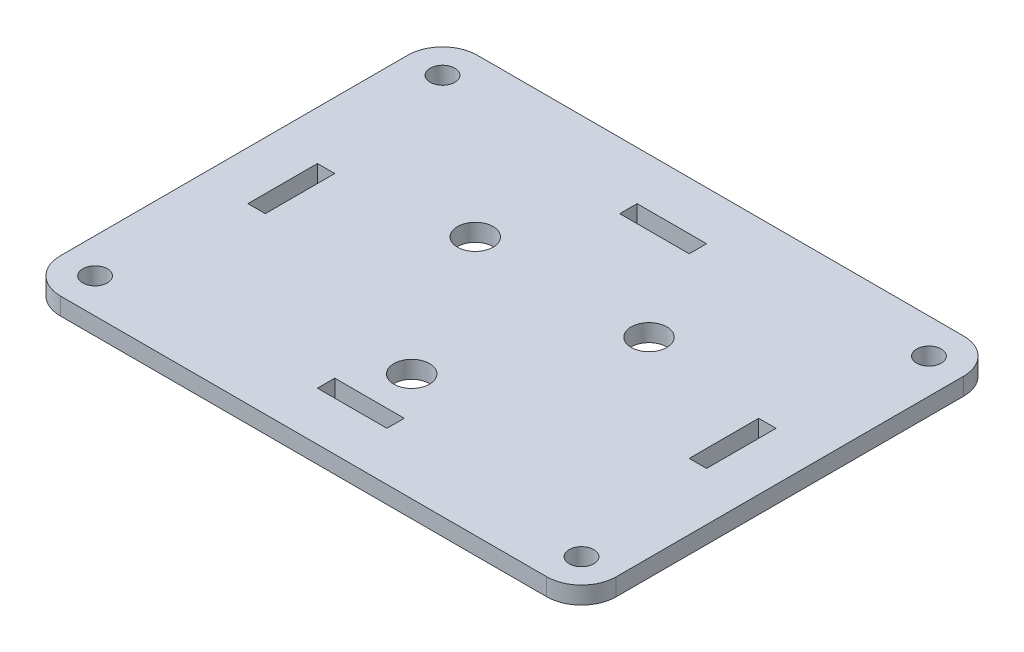
ISO-10303-21;
HEADER;
FILE_DESCRIPTION(('STEP AP214'),'2;1');
FILE_NAME('part.step','',(''),(''),'','','');
FILE_SCHEMA(('AUTOMOTIVE_DESIGN { 1 0 10303 214 1 1 1 1 }'));
ENDSEC;
DATA;
#1=APPLICATION_CONTEXT('core data for automotive mechanical design processes');
#2=APPLICATION_PROTOCOL_DEFINITION('international standard','automotive_design',2000,#1);
#3=PRODUCT_CONTEXT('',#1,'mechanical');
#4=PRODUCT('Part','Part','',(#3));
#5=PRODUCT_RELATED_PRODUCT_CATEGORY('part','',(#4));
#6=PRODUCT_DEFINITION_FORMATION('','',#4);
#7=PRODUCT_DEFINITION_CONTEXT('part definition',#1,'design');
#8=PRODUCT_DEFINITION('design','',#6,#7);
#9=PRODUCT_DEFINITION_SHAPE('','',#8);
#10=(LENGTH_UNIT() NAMED_UNIT(*) SI_UNIT(.MILLI.,.METRE.));
#11=(NAMED_UNIT(*) PLANE_ANGLE_UNIT() SI_UNIT($,.RADIAN.));
#12=(NAMED_UNIT(*) SI_UNIT($,.STERADIAN.) SOLID_ANGLE_UNIT());
#13=UNCERTAINTY_MEASURE_WITH_UNIT(LENGTH_MEASURE(1.E-05),#10,'distance_accuracy_value','');
#14=(GEOMETRIC_REPRESENTATION_CONTEXT(3) GLOBAL_UNCERTAINTY_ASSIGNED_CONTEXT((#13)) GLOBAL_UNIT_ASSIGNED_CONTEXT((#10,
#11,#12)) REPRESENTATION_CONTEXT('',''));
#15=CARTESIAN_POINT('',(0.,0.,0.));
#16=DIRECTION('',(0.,0.,1.));
#17=DIRECTION('',(1.,0.,0.));
#18=AXIS2_PLACEMENT_3D('',#15,#16,#17);
#19=CARTESIAN_POINT('',(50.8,3.175,38.1));
#20=DIRECTION('',(-1.,0.,0.));
#21=DIRECTION('',(0.,0.,1.));
#22=AXIS2_PLACEMENT_3D('',#19,#20,#21);
#23=PLANE('',#22);
#24=DIRECTION('',(0.,0.,-1.));
#25=VECTOR('',#24,1.);
#26=CARTESIAN_POINT('',(50.8,3.175,38.1));
#27=LINE('',#26,#25);
#28=CARTESIAN_POINT('',(50.8,3.175,31.75));
#29=VERTEX_POINT('',#28);
#30=CARTESIAN_POINT('',(50.8,3.175,-31.75));
#31=VERTEX_POINT('',#30);
#32=EDGE_CURVE('E395',#29,#31,#27,.T.);
#33=ORIENTED_EDGE('',*,*,#32,.F.);
#34=DIRECTION('',(0.,-1.,0.));
#35=VECTOR('',#34,1.);
#36=CARTESIAN_POINT('',(50.8,3.175,31.75));
#37=LINE('',#36,#35);
#38=CARTESIAN_POINT('',(50.8,0.,31.75));
#39=VERTEX_POINT('',#38);
#40=EDGE_CURVE('E429',#29,#39,#37,.T.);
#41=ORIENTED_EDGE('',*,*,#40,.T.);
#42=DIRECTION('',(0.,0.,-1.));
#43=VECTOR('',#42,1.);
#44=CARTESIAN_POINT('',(50.8,0.,38.1));
#45=LINE('',#44,#43);
#46=CARTESIAN_POINT('',(50.8,0.,-31.75));
#47=VERTEX_POINT('',#46);
#48=EDGE_CURVE('E386',#39,#47,#45,.T.);
#49=ORIENTED_EDGE('',*,*,#48,.T.);
#50=DIRECTION('',(0.,-1.,0.));
#51=VECTOR('',#50,1.);
#52=CARTESIAN_POINT('',(50.8,3.175,-31.75));
#53=LINE('',#52,#51);
#54=EDGE_CURVE('E412',#47,#31,#53,.F.);
#55=ORIENTED_EDGE('',*,*,#54,.T.);
#56=EDGE_LOOP('',(#33,#41,#49,#55));
#57=FACE_BOUND('',#56,.T.);
#58=ADVANCED_FACE('F39',(#57),#23,.F.);
#59=CARTESIAN_POINT('',(-50.8,3.175,-38.1));
#60=DIRECTION('',(0.,0.,1.));
#61=DIRECTION('',(1.,0.,0.));
#62=AXIS2_PLACEMENT_3D('',#59,#60,#61);
#63=PLANE('',#62);
#64=DIRECTION('',(-1.,0.,0.));
#65=VECTOR('',#64,1.);
#66=CARTESIAN_POINT('',(-50.8,3.175,-38.1));
#67=LINE('',#66,#65);
#68=CARTESIAN_POINT('',(44.45,3.175,-38.1));
#69=VERTEX_POINT('',#68);
#70=CARTESIAN_POINT('',(-44.45,3.175,-38.1));
#71=VERTEX_POINT('',#70);
#72=EDGE_CURVE('E399',#69,#71,#67,.T.);
#73=ORIENTED_EDGE('',*,*,#72,.F.);
#74=DIRECTION('',(0.,-1.,0.));
#75=VECTOR('',#74,1.);
#76=CARTESIAN_POINT('',(44.45,3.175,-38.1));
#77=LINE('',#76,#75);
#78=CARTESIAN_POINT('',(44.45,0.,-38.1));
#79=VERTEX_POINT('',#78);
#80=EDGE_CURVE('E467',#69,#79,#77,.T.);
#81=ORIENTED_EDGE('',*,*,#80,.T.);
#82=DIRECTION('',(-1.,0.,0.));
#83=VECTOR('',#82,1.);
#84=CARTESIAN_POINT('',(-50.8,0.,-38.1));
#85=LINE('',#84,#83);
#86=CARTESIAN_POINT('',(-44.45,0.,-38.1));
#87=VERTEX_POINT('',#86);
#88=EDGE_CURVE('E416',#79,#87,#85,.T.);
#89=ORIENTED_EDGE('',*,*,#88,.T.);
#90=DIRECTION('',(0.,-1.,0.));
#91=VECTOR('',#90,1.);
#92=CARTESIAN_POINT('',(-44.45,3.175,-38.1));
#93=LINE('',#92,#91);
#94=EDGE_CURVE('E464',#87,#71,#93,.F.);
#95=ORIENTED_EDGE('',*,*,#94,.T.);
#96=EDGE_LOOP('',(#73,#81,#89,#95));
#97=FACE_BOUND('',#96,.T.);
#98=ADVANCED_FACE('F504',(#97),#63,.F.);
#99=CARTESIAN_POINT('',(-50.8,3.175,38.1));
#100=DIRECTION('',(1.,0.,0.));
#101=DIRECTION('',(0.,0.,-1.));
#102=AXIS2_PLACEMENT_3D('',#99,#100,#101);
#103=PLANE('',#102);
#104=DIRECTION('',(0.,0.,1.));
#105=VECTOR('',#104,1.);
#106=CARTESIAN_POINT('',(-50.8,3.175,38.1));
#107=LINE('',#106,#105);
#108=CARTESIAN_POINT('',(-50.8,3.175,-31.75));
#109=VERTEX_POINT('',#108);
#110=CARTESIAN_POINT('',(-50.8,3.175,31.75));
#111=VERTEX_POINT('',#110);
#112=EDGE_CURVE('E404',#109,#111,#107,.T.);
#113=ORIENTED_EDGE('',*,*,#112,.F.);
#114=DIRECTION('',(0.,-1.,0.));
#115=VECTOR('',#114,1.);
#116=CARTESIAN_POINT('',(-50.8,3.175,-31.75));
#117=LINE('',#116,#115);
#118=CARTESIAN_POINT('',(-50.8,0.,-31.75));
#119=VERTEX_POINT('',#118);
#120=EDGE_CURVE('E11',#109,#119,#117,.T.);
#121=ORIENTED_EDGE('',*,*,#120,.T.);
#122=DIRECTION('',(0.,0.,1.));
#123=VECTOR('',#122,1.);
#124=CARTESIAN_POINT('',(-50.8,0.,38.1));
#125=LINE('',#124,#123);
#126=CARTESIAN_POINT('',(-50.8,0.,31.75));
#127=VERTEX_POINT('',#126);
#128=EDGE_CURVE('E420',#119,#127,#125,.T.);
#129=ORIENTED_EDGE('',*,*,#128,.T.);
#130=DIRECTION('',(0.,-1.,0.));
#131=VECTOR('',#130,1.);
#132=CARTESIAN_POINT('',(-50.8,3.175,31.75));
#133=LINE('',#132,#131);
#134=EDGE_CURVE('E48',#127,#111,#133,.F.);
#135=ORIENTED_EDGE('',*,*,#134,.T.);
#136=EDGE_LOOP('',(#113,#121,#129,#135));
#137=FACE_BOUND('',#136,.T.);
#138=ADVANCED_FACE('F474',(#137),#103,.F.);
#139=CARTESIAN_POINT('',(-50.8,3.175,38.1));
#140=DIRECTION('',(0.,0.,-1.));
#141=DIRECTION('',(-1.,0.,0.));
#142=AXIS2_PLACEMENT_3D('',#139,#140,#141);
#143=PLANE('',#142);
#144=DIRECTION('',(1.,0.,0.));
#145=VECTOR('',#144,1.);
#146=CARTESIAN_POINT('',(-50.8,0.,38.1));
#147=LINE('',#146,#145);
#148=CARTESIAN_POINT('',(-44.45,0.,38.1));
#149=VERTEX_POINT('',#148);
#150=CARTESIAN_POINT('',(44.45,0.,38.1));
#151=VERTEX_POINT('',#150);
#152=EDGE_CURVE('E400',#149,#151,#147,.T.);
#153=ORIENTED_EDGE('',*,*,#152,.T.);
#154=DIRECTION('',(0.,-1.,0.));
#155=VECTOR('',#154,1.);
#156=CARTESIAN_POINT('',(44.45,3.175,38.1));
#157=LINE('',#156,#155);
#158=CARTESIAN_POINT('',(44.45,3.175,38.1));
#159=VERTEX_POINT('',#158);
#160=EDGE_CURVE('E449',#151,#159,#157,.F.);
#161=ORIENTED_EDGE('',*,*,#160,.T.);
#162=DIRECTION('',(1.,0.,0.));
#163=VECTOR('',#162,1.);
#164=CARTESIAN_POINT('',(-50.8,3.175,38.1));
#165=LINE('',#164,#163);
#166=CARTESIAN_POINT('',(-44.45,3.175,38.1));
#167=VERTEX_POINT('',#166);
#168=EDGE_CURVE('E408',#167,#159,#165,.T.);
#169=ORIENTED_EDGE('',*,*,#168,.F.);
#170=DIRECTION('',(0.,-1.,0.));
#171=VECTOR('',#170,1.);
#172=CARTESIAN_POINT('',(-44.45,3.175,38.1));
#173=LINE('',#172,#171);
#174=EDGE_CURVE('E445',#167,#149,#173,.T.);
#175=ORIENTED_EDGE('',*,*,#174,.T.);
#176=EDGE_LOOP('',(#153,#161,#169,#175));
#177=FACE_BOUND('',#176,.T.);
#178=ADVANCED_FACE('F486',(#177),#143,.F.);
#179=CARTESIAN_POINT('',(0.,3.175,0.));
#180=DIRECTION('',(0.,-1.,0.));
#181=DIRECTION('',(0.,0.,-1.));
#182=AXIS2_PLACEMENT_3D('',#179,#180,#181);
#183=PLANE('',#182);
#184=CARTESIAN_POINT('',(-15.875,3.175,-9.16543552338531));
#185=DIRECTION('',(0.,1.,0.));
#186=DIRECTION('',(0.,0.,1.));
#187=AXIS2_PLACEMENT_3D('',#184,#185,#186);
#188=CIRCLE('',#187,3.2639);
#189=CARTESIAN_POINT('',(-15.875,3.175,-5.9015355233853));
#190=VERTEX_POINT('',#189);
#191=EDGE_CURVE('E882',#190,#190,#188,.T.);
#192=ORIENTED_EDGE('',*,*,#191,.F.);
#193=EDGE_LOOP('',(#192));
#194=FACE_BOUND('',#193,.T.);
#195=CARTESIAN_POINT('',(15.875,3.175,-9.16543552338531));
#196=DIRECTION('',(0.,1.,0.));
#197=DIRECTION('',(0.,0.,1.));
#198=AXIS2_PLACEMENT_3D('',#195,#196,#197);
#199=CIRCLE('',#198,3.2639);
#200=CARTESIAN_POINT('',(15.875,3.175,-5.9015355233853));
#201=VERTEX_POINT('',#200);
#202=EDGE_CURVE('E874',#201,#201,#199,.T.);
#203=ORIENTED_EDGE('',*,*,#202,.F.);
#204=EDGE_LOOP('',(#203));
#205=FACE_BOUND('',#204,.T.);
#206=CARTESIAN_POINT('',(0.,3.175,18.3308710467706));
#207=DIRECTION('',(0.,1.,0.));
#208=DIRECTION('',(0.,0.,1.));
#209=AXIS2_PLACEMENT_3D('',#206,#207,#208);
#210=CIRCLE('',#209,3.2639);
#211=CARTESIAN_POINT('',(0.,3.175,21.5947710467706));
#212=VERTEX_POINT('',#211);
#213=EDGE_CURVE('E866',#212,#212,#210,.T.);
#214=ORIENTED_EDGE('',*,*,#213,.F.);
#215=EDGE_LOOP('',(#214));
#216=FACE_BOUND('',#215,.T.);
#217=CARTESIAN_POINT('',(-44.45,3.175,-31.75));
#218=DIRECTION('',(0.,1.,0.));
#219=DIRECTION('',(0.,0.,1.));
#220=AXIS2_PLACEMENT_3D('',#217,#218,#219);
#221=CIRCLE('',#220,2.2479);
#222=CARTESIAN_POINT('',(-44.45,3.175,-29.5021));
#223=VERTEX_POINT('',#222);
#224=EDGE_CURVE('E260',#223,#223,#221,.T.);
#225=ORIENTED_EDGE('',*,*,#224,.F.);
#226=EDGE_LOOP('',(#225));
#227=FACE_BOUND('',#226,.T.);
#228=DIRECTION('',(1.,0.,0.));
#229=VECTOR('',#228,1.);
#230=CARTESIAN_POINT('',(0.,3.175,29.21));
#231=LINE('',#230,#229);
#232=CARTESIAN_POINT('',(-6.35,3.175,29.21));
#233=VERTEX_POINT('',#232);
#234=CARTESIAN_POINT('',(6.35,3.175,29.21));
#235=VERTEX_POINT('',#234);
#236=EDGE_CURVE('E237',#233,#235,#231,.T.);
#237=ORIENTED_EDGE('',*,*,#236,.F.);
#238=DIRECTION('',(0.,0.,1.));
#239=VECTOR('',#238,1.);
#240=CARTESIAN_POINT('',(-6.35,3.175,26.035));
#241=LINE('',#240,#239);
#242=CARTESIAN_POINT('',(-6.35,3.175,26.035));
#243=VERTEX_POINT('',#242);
#244=EDGE_CURVE('E55',#243,#233,#241,.T.);
#245=ORIENTED_EDGE('',*,*,#244,.F.);
#246=DIRECTION('',(-1.,0.,0.));
#247=VECTOR('',#246,1.);
#248=CARTESIAN_POINT('',(6.35,3.175,26.035));
#249=LINE('',#248,#247);
#250=CARTESIAN_POINT('',(6.35,3.175,26.035));
#251=VERTEX_POINT('',#250);
#252=EDGE_CURVE('E244',#251,#243,#249,.T.);
#253=ORIENTED_EDGE('',*,*,#252,.F.);
#254=DIRECTION('',(0.,0.,-1.));
#255=VECTOR('',#254,1.);
#256=CARTESIAN_POINT('',(6.35,3.175,29.21));
#257=LINE('',#256,#255);
#258=EDGE_CURVE('E207',#235,#251,#257,.T.);
#259=ORIENTED_EDGE('',*,*,#258,.F.);
#260=EDGE_LOOP('',(#237,#245,#253,#259));
#261=FACE_BOUND('',#260,.T.);
#262=DIRECTION('',(0.,0.,-1.));
#263=VECTOR('',#262,1.);
#264=CARTESIAN_POINT('',(41.91,3.175,0.));
#265=LINE('',#264,#263);
#266=CARTESIAN_POINT('',(41.91,3.175,6.35));
#267=VERTEX_POINT('',#266);
#268=CARTESIAN_POINT('',(41.91,3.175,-6.35));
#269=VERTEX_POINT('',#268);
#270=EDGE_CURVE('E252',#267,#269,#265,.T.);
#271=ORIENTED_EDGE('',*,*,#270,.F.);
#272=DIRECTION('',(1.,0.,0.));
#273=VECTOR('',#272,1.);
#274=CARTESIAN_POINT('',(38.735,3.175,6.35));
#275=LINE('',#274,#273);
#276=CARTESIAN_POINT('',(38.735,3.175,6.35));
#277=VERTEX_POINT('',#276);
#278=EDGE_CURVE('E63',#277,#267,#275,.T.);
#279=ORIENTED_EDGE('',*,*,#278,.F.);
#280=DIRECTION('',(0.,0.,1.));
#281=VECTOR('',#280,1.);
#282=CARTESIAN_POINT('',(38.735,3.175,-6.35));
#283=LINE('',#282,#281);
#284=CARTESIAN_POINT('',(38.735,3.175,-6.35));
#285=VERTEX_POINT('',#284);
#286=EDGE_CURVE('E335',#285,#277,#283,.T.);
#287=ORIENTED_EDGE('',*,*,#286,.F.);
#288=DIRECTION('',(-1.,0.,0.));
#289=VECTOR('',#288,1.);
#290=CARTESIAN_POINT('',(41.91,3.175,-6.35));
#291=LINE('',#290,#289);
#292=EDGE_CURVE('E331',#269,#285,#291,.T.);
#293=ORIENTED_EDGE('',*,*,#292,.F.);
#294=EDGE_LOOP('',(#271,#279,#287,#293));
#295=FACE_BOUND('',#294,.T.);
#296=DIRECTION('',(0.,0.,1.));
#297=VECTOR('',#296,1.);
#298=CARTESIAN_POINT('',(-6.35000000000001,3.175,-26.035));
#299=LINE('',#298,#297);
#300=CARTESIAN_POINT('',(-6.35000000000001,3.175,-29.21));
#301=VERTEX_POINT('',#300);
#302=CARTESIAN_POINT('',(-6.35000000000001,3.175,-26.035));
#303=VERTEX_POINT('',#302);
#304=EDGE_CURVE('E283',#301,#303,#299,.T.);
#305=ORIENTED_EDGE('',*,*,#304,.F.);
#306=DIRECTION('',(-1.,0.,0.));
#307=VECTOR('',#306,1.);
#308=CARTESIAN_POINT('',(0.,3.175,-29.21));
#309=LINE('',#308,#307);
#310=CARTESIAN_POINT('',(6.34999999999999,3.175,-29.21));
#311=VERTEX_POINT('',#310);
#312=EDGE_CURVE('E270',#311,#301,#309,.T.);
#313=ORIENTED_EDGE('',*,*,#312,.F.);
#314=DIRECTION('',(0.,0.,-1.));
#315=VECTOR('',#314,1.);
#316=CARTESIAN_POINT('',(6.34999999999999,3.175,-29.21));
#317=LINE('',#316,#315);
#318=CARTESIAN_POINT('',(6.34999999999999,3.175,-26.035));
#319=VERTEX_POINT('',#318);
#320=EDGE_CURVE('E292',#319,#311,#317,.T.);
#321=ORIENTED_EDGE('',*,*,#320,.F.);
#322=DIRECTION('',(1.,0.,0.));
#323=VECTOR('',#322,1.);
#324=CARTESIAN_POINT('',(6.34999999999999,3.175,-26.035));
#325=LINE('',#324,#323);
#326=EDGE_CURVE('E287',#303,#319,#325,.T.);
#327=ORIENTED_EDGE('',*,*,#326,.F.);
#328=EDGE_LOOP('',(#305,#313,#321,#327));
#329=FACE_BOUND('',#328,.T.);
#330=CARTESIAN_POINT('',(44.45,3.175,-31.75));
#331=DIRECTION('',(0.,1.,0.));
#332=DIRECTION('',(0.,0.,1.));
#333=AXIS2_PLACEMENT_3D('',#330,#331,#332);
#334=CIRCLE('',#333,2.2479);
#335=CARTESIAN_POINT('',(44.45,3.175,-29.5021));
#336=VERTEX_POINT('',#335);
#337=EDGE_CURVE('E860',#336,#336,#334,.T.);
#338=ORIENTED_EDGE('',*,*,#337,.F.);
#339=EDGE_LOOP('',(#338));
#340=FACE_BOUND('',#339,.T.);
#341=CARTESIAN_POINT('',(44.45,3.175,31.75));
#342=DIRECTION('',(0.,1.,0.));
#343=DIRECTION('',(0.,0.,1.));
#344=AXIS2_PLACEMENT_3D('',#341,#342,#343);
#345=CIRCLE('',#344,2.2479);
#346=CARTESIAN_POINT('',(44.45,3.175,33.9979));
#347=VERTEX_POINT('',#346);
#348=EDGE_CURVE('E848',#347,#347,#345,.T.);
#349=ORIENTED_EDGE('',*,*,#348,.F.);
#350=EDGE_LOOP('',(#349));
#351=FACE_BOUND('',#350,.T.);
#352=CARTESIAN_POINT('',(-44.45,3.175,31.75));
#353=DIRECTION('',(0.,1.,0.));
#354=DIRECTION('',(0.,0.,1.));
#355=AXIS2_PLACEMENT_3D('',#352,#353,#354);
#356=CIRCLE('',#355,2.2479);
#357=CARTESIAN_POINT('',(-44.45,3.175,33.9979));
#358=VERTEX_POINT('',#357);
#359=EDGE_CURVE('E849',#358,#358,#356,.T.);
#360=ORIENTED_EDGE('',*,*,#359,.F.);
#361=EDGE_LOOP('',(#360));
#362=FACE_BOUND('',#361,.T.);
#363=DIRECTION('',(1.,0.,0.));
#364=VECTOR('',#363,1.);
#365=CARTESIAN_POINT('',(-38.735,3.175,6.35000000000002));
#366=LINE('',#365,#364);
#367=CARTESIAN_POINT('',(-41.91,3.175,6.35000000000001));
#368=VERTEX_POINT('',#367);
#369=CARTESIAN_POINT('',(-38.735,3.175,6.35000000000002));
#370=VERTEX_POINT('',#369);
#371=EDGE_CURVE('E302',#368,#370,#366,.T.);
#372=ORIENTED_EDGE('',*,*,#371,.F.);
#373=DIRECTION('',(0.,0.,1.));
#374=VECTOR('',#373,1.);
#375=CARTESIAN_POINT('',(-41.91,3.175,0.));
#376=LINE('',#375,#374);
#377=CARTESIAN_POINT('',(-41.91,3.175,-6.34999999999999));
#378=VERTEX_POINT('',#377);
#379=EDGE_CURVE('E356',#378,#368,#376,.T.);
#380=ORIENTED_EDGE('',*,*,#379,.F.);
#381=DIRECTION('',(-1.,0.,0.));
#382=VECTOR('',#381,1.);
#383=CARTESIAN_POINT('',(-41.91,3.175,-6.34999999999999));
#384=LINE('',#383,#382);
#385=CARTESIAN_POINT('',(-38.735,3.175,-6.34999999999999));
#386=VERTEX_POINT('',#385);
#387=EDGE_CURVE('E376',#386,#378,#384,.T.);
#388=ORIENTED_EDGE('',*,*,#387,.F.);
#389=DIRECTION('',(0.,0.,-1.));
#390=VECTOR('',#389,1.);
#391=CARTESIAN_POINT('',(-38.735,3.175,-6.34999999999999));
#392=LINE('',#391,#390);
#393=EDGE_CURVE('E372',#370,#386,#392,.T.);
#394=ORIENTED_EDGE('',*,*,#393,.F.);
#395=EDGE_LOOP('',(#372,#380,#388,#394));
#396=FACE_BOUND('',#395,.T.);
#397=ORIENTED_EDGE('',*,*,#168,.T.);
#398=CARTESIAN_POINT('',(44.45,3.175,31.75));
#399=DIRECTION('',(0.,-1.,0.));
#400=DIRECTION('',(0.,0.,-1.));
#401=AXIS2_PLACEMENT_3D('',#398,#399,#400);
#402=CIRCLE('',#401,6.35);
#403=EDGE_CURVE('E461',#159,#29,#402,.F.);
#404=ORIENTED_EDGE('',*,*,#403,.T.);
#405=ORIENTED_EDGE('',*,*,#32,.T.);
#406=CARTESIAN_POINT('',(44.45,3.175,-31.75));
#407=DIRECTION('',(0.,-1.,0.));
#408=DIRECTION('',(0.,0.,-1.));
#409=AXIS2_PLACEMENT_3D('',#406,#407,#408);
#410=CIRCLE('',#409,6.35);
#411=EDGE_CURVE('E458',#31,#69,#410,.F.);
#412=ORIENTED_EDGE('',*,*,#411,.T.);
#413=ORIENTED_EDGE('',*,*,#72,.T.);
#414=CARTESIAN_POINT('',(-44.45,3.175,-31.75));
#415=DIRECTION('',(0.,-1.,0.));
#416=DIRECTION('',(0.,0.,-1.));
#417=AXIS2_PLACEMENT_3D('',#414,#415,#416);
#418=CIRCLE('',#417,6.35);
#419=EDGE_CURVE('E455',#71,#109,#418,.F.);
#420=ORIENTED_EDGE('',*,*,#419,.T.);
#421=ORIENTED_EDGE('',*,*,#112,.T.);
#422=CARTESIAN_POINT('',(-44.45,3.175,31.75));
#423=DIRECTION('',(0.,-1.,0.));
#424=DIRECTION('',(0.,0.,-1.));
#425=AXIS2_PLACEMENT_3D('',#422,#423,#424);
#426=CIRCLE('',#425,6.35);
#427=EDGE_CURVE('E452',#111,#167,#426,.F.);
#428=ORIENTED_EDGE('',*,*,#427,.T.);
#429=EDGE_LOOP('',(#397,#404,#405,#412,#413,#420,#421,#428));
#430=FACE_BOUND('',#429,.T.);
#431=ADVANCED_FACE('F480',(#194,#205,#216,#227,#261,#295,#329,#340,#351,#362,#396,#430),#183,.F.);
#432=CARTESIAN_POINT('',(0.,0.,0.));
#433=DIRECTION('',(0.,-1.,0.));
#434=DIRECTION('',(0.,0.,-1.));
#435=AXIS2_PLACEMENT_3D('',#432,#433,#434);
#436=PLANE('',#435);
#437=CARTESIAN_POINT('',(-15.875,0.,-9.16543552338531));
#438=DIRECTION('',(0.,1.,0.));
#439=DIRECTION('',(0.,0.,1.));
#440=AXIS2_PLACEMENT_3D('',#437,#438,#439);
#441=CIRCLE('',#440,3.2639);
#442=CARTESIAN_POINT('',(-15.875,0.,-5.9015355233853));
#443=VERTEX_POINT('',#442);
#444=EDGE_CURVE('E856',#443,#443,#441,.T.);
#445=ORIENTED_EDGE('',*,*,#444,.T.);
#446=EDGE_LOOP('',(#445));
#447=FACE_BOUND('',#446,.T.);
#448=CARTESIAN_POINT('',(15.875,0.,-9.16543552338531));
#449=DIRECTION('',(0.,1.,0.));
#450=DIRECTION('',(0.,0.,1.));
#451=AXIS2_PLACEMENT_3D('',#448,#449,#450);
#452=CIRCLE('',#451,3.2639);
#453=CARTESIAN_POINT('',(15.875,0.,-5.9015355233853));
#454=VERTEX_POINT('',#453);
#455=EDGE_CURVE('E878',#454,#454,#452,.T.);
#456=ORIENTED_EDGE('',*,*,#455,.T.);
#457=EDGE_LOOP('',(#456));
#458=FACE_BOUND('',#457,.T.);
#459=CARTESIAN_POINT('',(0.,0.,18.3308710467706));
#460=DIRECTION('',(0.,1.,0.));
#461=DIRECTION('',(0.,0.,1.));
#462=AXIS2_PLACEMENT_3D('',#459,#460,#461);
#463=CIRCLE('',#462,3.2639);
#464=CARTESIAN_POINT('',(0.,0.,21.5947710467706));
#465=VERTEX_POINT('',#464);
#466=EDGE_CURVE('E870',#465,#465,#463,.T.);
#467=ORIENTED_EDGE('',*,*,#466,.T.);
#468=EDGE_LOOP('',(#467));
#469=FACE_BOUND('',#468,.T.);
#470=CARTESIAN_POINT('',(-44.45,0.,-31.75));
#471=DIRECTION('',(0.,1.,0.));
#472=DIRECTION('',(0.,0.,1.));
#473=AXIS2_PLACEMENT_3D('',#470,#471,#472);
#474=CIRCLE('',#473,2.2479);
#475=CARTESIAN_POINT('',(-44.45,0.,-29.5021));
#476=VERTEX_POINT('',#475);
#477=EDGE_CURVE('E241',#476,#476,#474,.T.);
#478=ORIENTED_EDGE('',*,*,#477,.T.);
#479=EDGE_LOOP('',(#478));
#480=FACE_BOUND('',#479,.T.);
#481=DIRECTION('',(0.,0.,1.));
#482=VECTOR('',#481,1.);
#483=CARTESIAN_POINT('',(-6.35,0.,26.035));
#484=LINE('',#483,#482);
#485=CARTESIAN_POINT('',(-6.35,0.,26.035));
#486=VERTEX_POINT('',#485);
#487=CARTESIAN_POINT('',(-6.35,0.,29.21));
#488=VERTEX_POINT('',#487);
#489=EDGE_CURVE('E222',#486,#488,#484,.T.);
#490=ORIENTED_EDGE('',*,*,#489,.T.);
#491=DIRECTION('',(1.,0.,0.));
#492=VECTOR('',#491,1.);
#493=CARTESIAN_POINT('',(-6.35,0.,29.21));
#494=LINE('',#493,#492);
#495=CARTESIAN_POINT('',(6.35,0.,29.21));
#496=VERTEX_POINT('',#495);
#497=EDGE_CURVE('E228',#488,#496,#494,.T.);
#498=ORIENTED_EDGE('',*,*,#497,.T.);
#499=DIRECTION('',(0.,0.,-1.));
#500=VECTOR('',#499,1.);
#501=CARTESIAN_POINT('',(6.35,0.,29.21));
#502=LINE('',#501,#500);
#503=CARTESIAN_POINT('',(6.35,0.,26.035));
#504=VERTEX_POINT('',#503);
#505=EDGE_CURVE('E204',#496,#504,#502,.T.);
#506=ORIENTED_EDGE('',*,*,#505,.T.);
#507=DIRECTION('',(-1.,0.,0.));
#508=VECTOR('',#507,1.);
#509=CARTESIAN_POINT('',(6.35,0.,26.035));
#510=LINE('',#509,#508);
#511=EDGE_CURVE('E216',#504,#486,#510,.T.);
#512=ORIENTED_EDGE('',*,*,#511,.T.);
#513=EDGE_LOOP('',(#490,#498,#506,#512));
#514=FACE_BOUND('',#513,.T.);
#515=DIRECTION('',(1.,0.,0.));
#516=VECTOR('',#515,1.);
#517=CARTESIAN_POINT('',(38.735,0.,6.35));
#518=LINE('',#517,#516);
#519=CARTESIAN_POINT('',(38.735,0.,6.35));
#520=VERTEX_POINT('',#519);
#521=CARTESIAN_POINT('',(41.91,0.,6.35));
#522=VERTEX_POINT('',#521);
#523=EDGE_CURVE('E323',#520,#522,#518,.T.);
#524=ORIENTED_EDGE('',*,*,#523,.T.);
#525=DIRECTION('',(0.,0.,-1.));
#526=VECTOR('',#525,1.);
#527=CARTESIAN_POINT('',(41.91,0.,6.35));
#528=LINE('',#527,#526);
#529=CARTESIAN_POINT('',(41.91,0.,-6.35));
#530=VERTEX_POINT('',#529);
#531=EDGE_CURVE('E311',#522,#530,#528,.T.);
#532=ORIENTED_EDGE('',*,*,#531,.T.);
#533=DIRECTION('',(-1.,0.,0.));
#534=VECTOR('',#533,1.);
#535=CARTESIAN_POINT('',(41.91,0.,-6.35));
#536=LINE('',#535,#534);
#537=CARTESIAN_POINT('',(38.735,0.,-6.35));
#538=VERTEX_POINT('',#537);
#539=EDGE_CURVE('E315',#530,#538,#536,.T.);
#540=ORIENTED_EDGE('',*,*,#539,.T.);
#541=DIRECTION('',(0.,0.,1.));
#542=VECTOR('',#541,1.);
#543=CARTESIAN_POINT('',(38.735,0.,-6.35));
#544=LINE('',#543,#542);
#545=EDGE_CURVE('E319',#538,#520,#544,.T.);
#546=ORIENTED_EDGE('',*,*,#545,.T.);
#547=EDGE_LOOP('',(#524,#532,#540,#546));
#548=FACE_BOUND('',#547,.T.);
#549=DIRECTION('',(-1.,0.,0.));
#550=VECTOR('',#549,1.);
#551=CARTESIAN_POINT('',(-6.35000000000001,0.,-29.21));
#552=LINE('',#551,#550);
#553=CARTESIAN_POINT('',(6.34999999999999,0.,-29.21));
#554=VERTEX_POINT('',#553);
#555=CARTESIAN_POINT('',(-6.35000000000001,0.,-29.21));
#556=VERTEX_POINT('',#555);
#557=EDGE_CURVE('E265',#554,#556,#552,.T.);
#558=ORIENTED_EDGE('',*,*,#557,.T.);
#559=DIRECTION('',(0.,0.,1.));
#560=VECTOR('',#559,1.);
#561=CARTESIAN_POINT('',(-6.35000000000001,0.,-26.035));
#562=LINE('',#561,#560);
#563=CARTESIAN_POINT('',(-6.35000000000001,0.,-26.035));
#564=VERTEX_POINT('',#563);
#565=EDGE_CURVE('E269',#556,#564,#562,.T.);
#566=ORIENTED_EDGE('',*,*,#565,.T.);
#567=DIRECTION('',(1.,0.,0.));
#568=VECTOR('',#567,1.);
#569=CARTESIAN_POINT('',(6.34999999999999,0.,-26.035));
#570=LINE('',#569,#568);
#571=CARTESIAN_POINT('',(6.34999999999999,0.,-26.035));
#572=VERTEX_POINT('',#571);
#573=EDGE_CURVE('E274',#564,#572,#570,.T.);
#574=ORIENTED_EDGE('',*,*,#573,.T.);
#575=DIRECTION('',(0.,0.,-1.));
#576=VECTOR('',#575,1.);
#577=CARTESIAN_POINT('',(6.34999999999999,0.,-29.21));
#578=LINE('',#577,#576);
#579=EDGE_CURVE('E278',#572,#554,#578,.T.);
#580=ORIENTED_EDGE('',*,*,#579,.T.);
#581=EDGE_LOOP('',(#558,#566,#574,#580));
#582=FACE_BOUND('',#581,.T.);
#583=CARTESIAN_POINT('',(44.45,0.,-31.75));
#584=DIRECTION('',(0.,1.,0.));
#585=DIRECTION('',(0.,0.,1.));
#586=AXIS2_PLACEMENT_3D('',#583,#584,#585);
#587=CIRCLE('',#586,2.2479);
#588=CARTESIAN_POINT('',(44.45,0.,-29.5021));
#589=VERTEX_POINT('',#588);
#590=EDGE_CURVE('E264',#589,#589,#587,.T.);
#591=ORIENTED_EDGE('',*,*,#590,.T.);
#592=EDGE_LOOP('',(#591));
#593=FACE_BOUND('',#592,.T.);
#594=CARTESIAN_POINT('',(44.45,0.,31.75));
#595=DIRECTION('',(0.,1.,0.));
#596=DIRECTION('',(0.,0.,1.));
#597=AXIS2_PLACEMENT_3D('',#594,#595,#596);
#598=CIRCLE('',#597,2.2479);
#599=CARTESIAN_POINT('',(44.45,0.,33.9979));
#600=VERTEX_POINT('',#599);
#601=EDGE_CURVE('E843',#600,#600,#598,.T.);
#602=ORIENTED_EDGE('',*,*,#601,.T.);
#603=EDGE_LOOP('',(#602));
#604=FACE_BOUND('',#603,.T.);
#605=CARTESIAN_POINT('',(-44.45,0.,31.75));
#606=DIRECTION('',(0.,1.,0.));
#607=DIRECTION('',(0.,0.,1.));
#608=AXIS2_PLACEMENT_3D('',#605,#606,#607);
#609=CIRCLE('',#608,2.2479);
#610=CARTESIAN_POINT('',(-44.45,0.,33.9979));
#611=VERTEX_POINT('',#610);
#612=EDGE_CURVE('E846',#611,#611,#609,.T.);
#613=ORIENTED_EDGE('',*,*,#612,.T.);
#614=EDGE_LOOP('',(#613));
#615=FACE_BOUND('',#614,.T.);
#616=DIRECTION('',(0.,0.,1.));
#617=VECTOR('',#616,1.);
#618=CARTESIAN_POINT('',(-41.91,0.,6.35000000000001));
#619=LINE('',#618,#617);
#620=CARTESIAN_POINT('',(-41.91,0.,-6.34999999999999));
#621=VERTEX_POINT('',#620);
#622=CARTESIAN_POINT('',(-41.91,0.,6.35000000000001));
#623=VERTEX_POINT('',#622);
#624=EDGE_CURVE('E351',#621,#623,#619,.T.);
#625=ORIENTED_EDGE('',*,*,#624,.T.);
#626=DIRECTION('',(1.,0.,0.));
#627=VECTOR('',#626,1.);
#628=CARTESIAN_POINT('',(-38.735,0.,6.35000000000002));
#629=LINE('',#628,#627);
#630=CARTESIAN_POINT('',(-38.735,0.,6.35000000000002));
#631=VERTEX_POINT('',#630);
#632=EDGE_CURVE('E355',#623,#631,#629,.T.);
#633=ORIENTED_EDGE('',*,*,#632,.T.);
#634=DIRECTION('',(0.,0.,-1.));
#635=VECTOR('',#634,1.);
#636=CARTESIAN_POINT('',(-38.735,0.,-6.34999999999999));
#637=LINE('',#636,#635);
#638=CARTESIAN_POINT('',(-38.735,0.,-6.34999999999999));
#639=VERTEX_POINT('',#638);
#640=EDGE_CURVE('E360',#631,#639,#637,.T.);
#641=ORIENTED_EDGE('',*,*,#640,.T.);
#642=DIRECTION('',(-1.,0.,0.));
#643=VECTOR('',#642,1.);
#644=CARTESIAN_POINT('',(-41.91,0.,-6.34999999999999));
#645=LINE('',#644,#643);
#646=EDGE_CURVE('E364',#639,#621,#645,.T.);
#647=ORIENTED_EDGE('',*,*,#646,.T.);
#648=EDGE_LOOP('',(#625,#633,#641,#647));
#649=FACE_BOUND('',#648,.T.);
#650=ORIENTED_EDGE('',*,*,#48,.F.);
#651=CARTESIAN_POINT('',(44.45,0.,31.75));
#652=DIRECTION('',(0.,-1.,0.));
#653=DIRECTION('',(0.,0.,-1.));
#654=AXIS2_PLACEMENT_3D('',#651,#652,#653);
#655=CIRCLE('',#654,6.35);
#656=EDGE_CURVE('E442',#39,#151,#655,.T.);
#657=ORIENTED_EDGE('',*,*,#656,.T.);
#658=ORIENTED_EDGE('',*,*,#152,.F.);
#659=CARTESIAN_POINT('',(-44.45,0.,31.75));
#660=DIRECTION('',(0.,-1.,0.));
#661=DIRECTION('',(0.,0.,-1.));
#662=AXIS2_PLACEMENT_3D('',#659,#660,#661);
#663=CIRCLE('',#662,6.35);
#664=EDGE_CURVE('E433',#149,#127,#663,.T.);
#665=ORIENTED_EDGE('',*,*,#664,.T.);
#666=ORIENTED_EDGE('',*,*,#128,.F.);
#667=CARTESIAN_POINT('',(-44.45,0.,-31.75));
#668=DIRECTION('',(0.,-1.,0.));
#669=DIRECTION('',(0.,0.,-1.));
#670=AXIS2_PLACEMENT_3D('',#667,#668,#669);
#671=CIRCLE('',#670,6.35);
#672=EDGE_CURVE('E436',#119,#87,#671,.T.);
#673=ORIENTED_EDGE('',*,*,#672,.T.);
#674=ORIENTED_EDGE('',*,*,#88,.F.);
#675=CARTESIAN_POINT('',(44.45,0.,-31.75));
#676=DIRECTION('',(0.,-1.,0.));
#677=DIRECTION('',(0.,0.,-1.));
#678=AXIS2_PLACEMENT_3D('',#675,#676,#677);
#679=CIRCLE('',#678,6.35);
#680=EDGE_CURVE('E439',#79,#47,#679,.T.);
#681=ORIENTED_EDGE('',*,*,#680,.T.);
#682=EDGE_LOOP('',(#650,#657,#658,#665,#666,#673,#674,#681));
#683=FACE_BOUND('',#682,.T.);
#684=ADVANCED_FACE('F225',(#447,#458,#469,#480,#514,#548,#582,#593,#604,#615,#649,#683),#436,.T.);
#685=CARTESIAN_POINT('',(44.45,3.175,31.75));
#686=DIRECTION('',(0.,-1.,0.));
#687=DIRECTION('',(0.,0.,-1.));
#688=AXIS2_PLACEMENT_3D('',#685,#686,#687);
#689=CYLINDRICAL_SURFACE('',#688,6.35);
#690=ORIENTED_EDGE('',*,*,#403,.F.);
#691=ORIENTED_EDGE('',*,*,#160,.F.);
#692=ORIENTED_EDGE('',*,*,#656,.F.);
#693=ORIENTED_EDGE('',*,*,#40,.F.);
#694=EDGE_LOOP('',(#690,#691,#692,#693));
#695=FACE_BOUND('',#694,.T.);
#696=ADVANCED_FACE('F493',(#695),#689,.T.);
#697=CARTESIAN_POINT('',(44.45,3.175,-31.75));
#698=DIRECTION('',(0.,-1.,0.));
#699=DIRECTION('',(0.,0.,-1.));
#700=AXIS2_PLACEMENT_3D('',#697,#698,#699);
#701=CYLINDRICAL_SURFACE('',#700,6.35);
#702=ORIENTED_EDGE('',*,*,#411,.F.);
#703=ORIENTED_EDGE('',*,*,#54,.F.);
#704=ORIENTED_EDGE('',*,*,#680,.F.);
#705=ORIENTED_EDGE('',*,*,#80,.F.);
#706=EDGE_LOOP('',(#702,#703,#704,#705));
#707=FACE_BOUND('',#706,.T.);
#708=ADVANCED_FACE('F501',(#707),#701,.T.);
#709=CARTESIAN_POINT('',(-44.45,3.175,-31.75));
#710=DIRECTION('',(0.,-1.,0.));
#711=DIRECTION('',(0.,0.,-1.));
#712=AXIS2_PLACEMENT_3D('',#709,#710,#711);
#713=CYLINDRICAL_SURFACE('',#712,6.35);
#714=ORIENTED_EDGE('',*,*,#419,.F.);
#715=ORIENTED_EDGE('',*,*,#94,.F.);
#716=ORIENTED_EDGE('',*,*,#672,.F.);
#717=ORIENTED_EDGE('',*,*,#120,.F.);
#718=EDGE_LOOP('',(#714,#715,#716,#717));
#719=FACE_BOUND('',#718,.T.);
#720=ADVANCED_FACE('F507',(#719),#713,.T.);
#721=CARTESIAN_POINT('',(-44.45,3.175,31.75));
#722=DIRECTION('',(0.,-1.,0.));
#723=DIRECTION('',(0.,0.,-1.));
#724=AXIS2_PLACEMENT_3D('',#721,#722,#723);
#725=CYLINDRICAL_SURFACE('',#724,6.35);
#726=ORIENTED_EDGE('',*,*,#427,.F.);
#727=ORIENTED_EDGE('',*,*,#134,.F.);
#728=ORIENTED_EDGE('',*,*,#664,.F.);
#729=ORIENTED_EDGE('',*,*,#174,.F.);
#730=EDGE_LOOP('',(#726,#727,#728,#729));
#731=FACE_BOUND('',#730,.T.);
#732=ADVANCED_FACE('F41',(#731),#725,.T.);
#733=CARTESIAN_POINT('',(-41.91,0.,0.));
#734=DIRECTION('',(-1.,0.,0.));
#735=DIRECTION('',(0.,0.,1.));
#736=AXIS2_PLACEMENT_3D('',#733,#734,#735);
#737=PLANE('',#736);
#738=ORIENTED_EDGE('',*,*,#379,.T.);
#739=DIRECTION('',(0.,1.,0.));
#740=VECTOR('',#739,1.);
#741=CARTESIAN_POINT('',(-41.91,0.,6.35000000000001));
#742=LINE('',#741,#740);
#743=EDGE_CURVE('E368',#623,#368,#742,.T.);
#744=ORIENTED_EDGE('',*,*,#743,.F.);
#745=ORIENTED_EDGE('',*,*,#624,.F.);
#746=DIRECTION('',(0.,1.,0.));
#747=VECTOR('',#746,1.);
#748=CARTESIAN_POINT('',(-41.91,0.,-6.34999999999999));
#749=LINE('',#748,#747);
#750=EDGE_CURVE('E383',#621,#378,#749,.T.);
#751=ORIENTED_EDGE('',*,*,#750,.T.);
#752=EDGE_LOOP('',(#738,#744,#745,#751));
#753=FACE_BOUND('',#752,.T.);
#754=ADVANCED_FACE('F513',(#753),#737,.F.);
#755=CARTESIAN_POINT('',(-41.91,0.,-6.34999999999999));
#756=DIRECTION('',(0.,0.,-1.));
#757=DIRECTION('',(-1.,0.,0.));
#758=AXIS2_PLACEMENT_3D('',#755,#756,#757);
#759=PLANE('',#758);
#760=ORIENTED_EDGE('',*,*,#387,.T.);
#761=ORIENTED_EDGE('',*,*,#750,.F.);
#762=ORIENTED_EDGE('',*,*,#646,.F.);
#763=DIRECTION('',(0.,1.,0.));
#764=VECTOR('',#763,1.);
#765=CARTESIAN_POINT('',(-38.735,0.,-6.34999999999999));
#766=LINE('',#765,#764);
#767=EDGE_CURVE('E387',#639,#386,#766,.T.);
#768=ORIENTED_EDGE('',*,*,#767,.T.);
#769=EDGE_LOOP('',(#760,#761,#762,#768));
#770=FACE_BOUND('',#769,.T.);
#771=ADVANCED_FACE('F659',(#770),#759,.F.);
#772=CARTESIAN_POINT('',(-38.735,0.,-6.34999999999999));
#773=DIRECTION('',(1.,0.,0.));
#774=DIRECTION('',(0.,0.,-1.));
#775=AXIS2_PLACEMENT_3D('',#772,#773,#774);
#776=PLANE('',#775);
#777=ORIENTED_EDGE('',*,*,#393,.T.);
#778=ORIENTED_EDGE('',*,*,#767,.F.);
#779=ORIENTED_EDGE('',*,*,#640,.F.);
#780=DIRECTION('',(0.,1.,0.));
#781=VECTOR('',#780,1.);
#782=CARTESIAN_POINT('',(-38.735,0.,6.35000000000002));
#783=LINE('',#782,#781);
#784=EDGE_CURVE('E390',#631,#370,#783,.T.);
#785=ORIENTED_EDGE('',*,*,#784,.T.);
#786=EDGE_LOOP('',(#777,#778,#779,#785));
#787=FACE_BOUND('',#786,.T.);
#788=ADVANCED_FACE('F663',(#787),#776,.F.);
#789=CARTESIAN_POINT('',(-38.735,0.,6.35000000000002));
#790=DIRECTION('',(0.,0.,1.));
#791=DIRECTION('',(1.,0.,0.));
#792=AXIS2_PLACEMENT_3D('',#789,#790,#791);
#793=PLANE('',#792);
#794=ORIENTED_EDGE('',*,*,#371,.T.);
#795=ORIENTED_EDGE('',*,*,#784,.F.);
#796=ORIENTED_EDGE('',*,*,#632,.F.);
#797=ORIENTED_EDGE('',*,*,#743,.T.);
#798=EDGE_LOOP('',(#794,#795,#796,#797));
#799=FACE_BOUND('',#798,.T.);
#800=ADVANCED_FACE('F612',(#799),#793,.F.);
#801=CARTESIAN_POINT('',(-44.45,0.,31.75));
#802=DIRECTION('',(0.,1.,0.));
#803=DIRECTION('',(0.,0.,1.));
#804=AXIS2_PLACEMENT_3D('',#801,#802,#803);
#805=CYLINDRICAL_SURFACE('',#804,2.2479);
#806=ORIENTED_EDGE('',*,*,#612,.F.);
#807=EDGE_LOOP('',(#806));
#808=FACE_BOUND('',#807,.T.);
#809=ORIENTED_EDGE('',*,*,#359,.T.);
#810=EDGE_LOOP('',(#809));
#811=FACE_BOUND('',#810,.T.);
#812=ADVANCED_FACE('F608',(#808,#811),#805,.F.);
#813=CARTESIAN_POINT('',(44.45,0.,31.75));
#814=DIRECTION('',(0.,1.,0.));
#815=DIRECTION('',(0.,0.,1.));
#816=AXIS2_PLACEMENT_3D('',#813,#814,#815);
#817=CYLINDRICAL_SURFACE('',#816,2.2479);
#818=ORIENTED_EDGE('',*,*,#601,.F.);
#819=EDGE_LOOP('',(#818));
#820=FACE_BOUND('',#819,.T.);
#821=ORIENTED_EDGE('',*,*,#348,.T.);
#822=EDGE_LOOP('',(#821));
#823=FACE_BOUND('',#822,.T.);
#824=ADVANCED_FACE('F604',(#820,#823),#817,.F.);
#825=CARTESIAN_POINT('',(44.45,0.,-31.75));
#826=DIRECTION('',(0.,1.,0.));
#827=DIRECTION('',(0.,0.,1.));
#828=AXIS2_PLACEMENT_3D('',#825,#826,#827);
#829=CYLINDRICAL_SURFACE('',#828,2.2479);
#830=ORIENTED_EDGE('',*,*,#590,.F.);
#831=EDGE_LOOP('',(#830));
#832=FACE_BOUND('',#831,.T.);
#833=ORIENTED_EDGE('',*,*,#337,.T.);
#834=EDGE_LOOP('',(#833));
#835=FACE_BOUND('',#834,.T.);
#836=ADVANCED_FACE('F600',(#832,#835),#829,.F.);
#837=CARTESIAN_POINT('',(0.,0.,-29.21));
#838=DIRECTION('',(0.,0.,-1.));
#839=DIRECTION('',(-1.,0.,0.));
#840=AXIS2_PLACEMENT_3D('',#837,#838,#839);
#841=PLANE('',#840);
#842=ORIENTED_EDGE('',*,*,#312,.T.);
#843=DIRECTION('',(0.,1.,0.));
#844=VECTOR('',#843,1.);
#845=CARTESIAN_POINT('',(-6.35000000000001,0.,-29.21));
#846=LINE('',#845,#844);
#847=EDGE_CURVE('E282',#556,#301,#846,.T.);
#848=ORIENTED_EDGE('',*,*,#847,.F.);
#849=ORIENTED_EDGE('',*,*,#557,.F.);
#850=DIRECTION('',(0.,1.,0.));
#851=VECTOR('',#850,1.);
#852=CARTESIAN_POINT('',(6.34999999999999,0.,-29.21));
#853=LINE('',#852,#851);
#854=EDGE_CURVE('E299',#554,#311,#853,.T.);
#855=ORIENTED_EDGE('',*,*,#854,.T.);
#856=EDGE_LOOP('',(#842,#848,#849,#855));
#857=FACE_BOUND('',#856,.T.);
#858=ADVANCED_FACE('F603',(#857),#841,.F.);
#859=CARTESIAN_POINT('',(6.34999999999999,0.,-29.21));
#860=DIRECTION('',(1.,0.,0.));
#861=DIRECTION('',(0.,0.,-1.));
#862=AXIS2_PLACEMENT_3D('',#859,#860,#861);
#863=PLANE('',#862);
#864=ORIENTED_EDGE('',*,*,#320,.T.);
#865=ORIENTED_EDGE('',*,*,#854,.F.);
#866=ORIENTED_EDGE('',*,*,#579,.F.);
#867=DIRECTION('',(0.,1.,0.));
#868=VECTOR('',#867,1.);
#869=CARTESIAN_POINT('',(6.34999999999999,0.,-26.035));
#870=LINE('',#869,#868);
#871=EDGE_CURVE('E303',#572,#319,#870,.T.);
#872=ORIENTED_EDGE('',*,*,#871,.T.);
#873=EDGE_LOOP('',(#864,#865,#866,#872));
#874=FACE_BOUND('',#873,.T.);
#875=ADVANCED_FACE('F630',(#874),#863,.F.);
#876=CARTESIAN_POINT('',(6.34999999999999,0.,-26.035));
#877=DIRECTION('',(0.,0.,1.));
#878=DIRECTION('',(1.,0.,0.));
#879=AXIS2_PLACEMENT_3D('',#876,#877,#878);
#880=PLANE('',#879);
#881=ORIENTED_EDGE('',*,*,#326,.T.);
#882=ORIENTED_EDGE('',*,*,#871,.F.);
#883=ORIENTED_EDGE('',*,*,#573,.F.);
#884=DIRECTION('',(0.,1.,0.));
#885=VECTOR('',#884,1.);
#886=CARTESIAN_POINT('',(-6.35000000000001,0.,-26.035));
#887=LINE('',#886,#885);
#888=EDGE_CURVE('E306',#564,#303,#887,.T.);
#889=ORIENTED_EDGE('',*,*,#888,.T.);
#890=EDGE_LOOP('',(#881,#882,#883,#889));
#891=FACE_BOUND('',#890,.T.);
#892=ADVANCED_FACE('F634',(#891),#880,.F.);
#893=CARTESIAN_POINT('',(-6.35000000000001,0.,-26.035));
#894=DIRECTION('',(-1.,0.,0.));
#895=DIRECTION('',(0.,0.,1.));
#896=AXIS2_PLACEMENT_3D('',#893,#894,#895);
#897=PLANE('',#896);
#898=ORIENTED_EDGE('',*,*,#304,.T.);
#899=ORIENTED_EDGE('',*,*,#888,.F.);
#900=ORIENTED_EDGE('',*,*,#565,.F.);
#901=ORIENTED_EDGE('',*,*,#847,.T.);
#902=EDGE_LOOP('',(#898,#899,#900,#901));
#903=FACE_BOUND('',#902,.T.);
#904=ADVANCED_FACE('F638',(#903),#897,.F.);
#905=CARTESIAN_POINT('',(38.735,0.,6.35));
#906=DIRECTION('',(0.,0.,1.));
#907=DIRECTION('',(1.,0.,0.));
#908=AXIS2_PLACEMENT_3D('',#905,#906,#907);
#909=PLANE('',#908);
#910=ORIENTED_EDGE('',*,*,#278,.T.);
#911=DIRECTION('',(0.,1.,0.));
#912=VECTOR('',#911,1.);
#913=CARTESIAN_POINT('',(41.91,0.,6.35));
#914=LINE('',#913,#912);
#915=EDGE_CURVE('E288',#522,#267,#914,.T.);
#916=ORIENTED_EDGE('',*,*,#915,.F.);
#917=ORIENTED_EDGE('',*,*,#523,.F.);
#918=DIRECTION('',(0.,1.,0.));
#919=VECTOR('',#918,1.);
#920=CARTESIAN_POINT('',(38.735,0.,6.35));
#921=LINE('',#920,#919);
#922=EDGE_CURVE('E343',#520,#277,#921,.T.);
#923=ORIENTED_EDGE('',*,*,#922,.T.);
#924=EDGE_LOOP('',(#910,#916,#917,#923));
#925=FACE_BOUND('',#924,.T.);
#926=ADVANCED_FACE('F642',(#925),#909,.F.);
#927=CARTESIAN_POINT('',(38.735,0.,-6.35));
#928=DIRECTION('',(-1.,0.,0.));
#929=DIRECTION('',(0.,0.,1.));
#930=AXIS2_PLACEMENT_3D('',#927,#928,#929);
#931=PLANE('',#930);
#932=ORIENTED_EDGE('',*,*,#286,.T.);
#933=ORIENTED_EDGE('',*,*,#922,.F.);
#934=ORIENTED_EDGE('',*,*,#545,.F.);
#935=DIRECTION('',(0.,1.,0.));
#936=VECTOR('',#935,1.);
#937=CARTESIAN_POINT('',(38.735,0.,-6.35));
#938=LINE('',#937,#936);
#939=EDGE_CURVE('E346',#538,#285,#938,.T.);
#940=ORIENTED_EDGE('',*,*,#939,.T.);
#941=EDGE_LOOP('',(#932,#933,#934,#940));
#942=FACE_BOUND('',#941,.T.);
#943=ADVANCED_FACE('F646',(#942),#931,.F.);
#944=CARTESIAN_POINT('',(41.91,0.,-6.35));
#945=DIRECTION('',(0.,0.,-1.));
#946=DIRECTION('',(-1.,0.,0.));
#947=AXIS2_PLACEMENT_3D('',#944,#945,#946);
#948=PLANE('',#947);
#949=ORIENTED_EDGE('',*,*,#292,.T.);
#950=ORIENTED_EDGE('',*,*,#939,.F.);
#951=ORIENTED_EDGE('',*,*,#539,.F.);
#952=DIRECTION('',(0.,1.,0.));
#953=VECTOR('',#952,1.);
#954=CARTESIAN_POINT('',(41.91,0.,-6.35));
#955=LINE('',#954,#953);
#956=EDGE_CURVE('E327',#530,#269,#955,.T.);
#957=ORIENTED_EDGE('',*,*,#956,.T.);
#958=EDGE_LOOP('',(#949,#950,#951,#957));
#959=FACE_BOUND('',#958,.T.);
#960=ADVANCED_FACE('F649',(#959),#948,.F.);
#961=CARTESIAN_POINT('',(41.91,0.,0.));
#962=DIRECTION('',(1.,0.,0.));
#963=DIRECTION('',(0.,0.,-1.));
#964=AXIS2_PLACEMENT_3D('',#961,#962,#963);
#965=PLANE('',#964);
#966=ORIENTED_EDGE('',*,*,#270,.T.);
#967=ORIENTED_EDGE('',*,*,#956,.F.);
#968=ORIENTED_EDGE('',*,*,#531,.F.);
#969=ORIENTED_EDGE('',*,*,#915,.T.);
#970=EDGE_LOOP('',(#966,#967,#968,#969));
#971=FACE_BOUND('',#970,.T.);
#972=ADVANCED_FACE('F617',(#971),#965,.F.);
#973=CARTESIAN_POINT('',(-6.35,0.,26.035));
#974=DIRECTION('',(-1.,0.,0.));
#975=DIRECTION('',(0.,0.,1.));
#976=AXIS2_PLACEMENT_3D('',#973,#974,#975);
#977=PLANE('',#976);
#978=ORIENTED_EDGE('',*,*,#244,.T.);
#979=DIRECTION('',(0.,1.,0.));
#980=VECTOR('',#979,1.);
#981=CARTESIAN_POINT('',(-6.35,0.,29.21));
#982=LINE('',#981,#980);
#983=EDGE_CURVE('E249',#488,#233,#982,.T.);
#984=ORIENTED_EDGE('',*,*,#983,.F.);
#985=ORIENTED_EDGE('',*,*,#489,.F.);
#986=DIRECTION('',(0.,1.,0.));
#987=VECTOR('',#986,1.);
#988=CARTESIAN_POINT('',(-6.35,0.,26.035));
#989=LINE('',#988,#987);
#990=EDGE_CURVE('E212',#486,#243,#989,.T.);
#991=ORIENTED_EDGE('',*,*,#990,.T.);
#992=EDGE_LOOP('',(#978,#984,#985,#991));
#993=FACE_BOUND('',#992,.T.);
#994=ADVANCED_FACE('F614',(#993),#977,.F.);
#995=CARTESIAN_POINT('',(6.35,0.,26.035));
#996=DIRECTION('',(0.,0.,-1.));
#997=DIRECTION('',(-1.,0.,0.));
#998=AXIS2_PLACEMENT_3D('',#995,#996,#997);
#999=PLANE('',#998);
#1000=ORIENTED_EDGE('',*,*,#252,.T.);
#1001=ORIENTED_EDGE('',*,*,#990,.F.);
#1002=ORIENTED_EDGE('',*,*,#511,.F.);
#1003=DIRECTION('',(0.,1.,0.));
#1004=VECTOR('',#1003,1.);
#1005=CARTESIAN_POINT('',(6.35,0.,26.035));
#1006=LINE('',#1005,#1004);
#1007=EDGE_CURVE('E200',#504,#251,#1006,.T.);
#1008=ORIENTED_EDGE('',*,*,#1007,.T.);
#1009=EDGE_LOOP('',(#1000,#1001,#1002,#1008));
#1010=FACE_BOUND('',#1009,.T.);
#1011=ADVANCED_FACE('F217',(#1010),#999,.F.);
#1012=CARTESIAN_POINT('',(6.35,0.,29.21));
#1013=DIRECTION('',(1.,0.,0.));
#1014=DIRECTION('',(0.,0.,-1.));
#1015=AXIS2_PLACEMENT_3D('',#1012,#1013,#1014);
#1016=PLANE('',#1015);
#1017=ORIENTED_EDGE('',*,*,#258,.T.);
#1018=ORIENTED_EDGE('',*,*,#1007,.F.);
#1019=ORIENTED_EDGE('',*,*,#505,.F.);
#1020=DIRECTION('',(0.,1.,0.));
#1021=VECTOR('',#1020,1.);
#1022=CARTESIAN_POINT('',(6.35,0.,29.21));
#1023=LINE('',#1022,#1021);
#1024=EDGE_CURVE('E213',#496,#235,#1023,.T.);
#1025=ORIENTED_EDGE('',*,*,#1024,.T.);
#1026=EDGE_LOOP('',(#1017,#1018,#1019,#1025));
#1027=FACE_BOUND('',#1026,.T.);
#1028=ADVANCED_FACE('F202',(#1027),#1016,.F.);
#1029=CARTESIAN_POINT('',(0.,0.,29.21));
#1030=DIRECTION('',(0.,0.,1.));
#1031=DIRECTION('',(1.,0.,0.));
#1032=AXIS2_PLACEMENT_3D('',#1029,#1030,#1031);
#1033=PLANE('',#1032);
#1034=ORIENTED_EDGE('',*,*,#236,.T.);
#1035=ORIENTED_EDGE('',*,*,#1024,.F.);
#1036=ORIENTED_EDGE('',*,*,#497,.F.);
#1037=ORIENTED_EDGE('',*,*,#983,.T.);
#1038=EDGE_LOOP('',(#1034,#1035,#1036,#1037));
#1039=FACE_BOUND('',#1038,.T.);
#1040=ADVANCED_FACE('F622',(#1039),#1033,.F.);
#1041=CARTESIAN_POINT('',(-44.45,0.,-31.75));
#1042=DIRECTION('',(0.,1.,0.));
#1043=DIRECTION('',(0.,0.,1.));
#1044=AXIS2_PLACEMENT_3D('',#1041,#1042,#1043);
#1045=CYLINDRICAL_SURFACE('',#1044,2.2479);
#1046=ORIENTED_EDGE('',*,*,#477,.F.);
#1047=EDGE_LOOP('',(#1046));
#1048=FACE_BOUND('',#1047,.T.);
#1049=ORIENTED_EDGE('',*,*,#224,.T.);
#1050=EDGE_LOOP('',(#1049));
#1051=FACE_BOUND('',#1050,.T.);
#1052=ADVANCED_FACE('F558',(#1048,#1051),#1045,.F.);
#1053=CARTESIAN_POINT('',(0.,0.,18.3308710467706));
#1054=DIRECTION('',(0.,1.,0.));
#1055=DIRECTION('',(0.,0.,1.));
#1056=AXIS2_PLACEMENT_3D('',#1053,#1054,#1055);
#1057=CYLINDRICAL_SURFACE('',#1056,3.2639);
#1058=ORIENTED_EDGE('',*,*,#466,.F.);
#1059=EDGE_LOOP('',(#1058));
#1060=FACE_BOUND('',#1059,.T.);
#1061=ORIENTED_EDGE('',*,*,#213,.T.);
#1062=EDGE_LOOP('',(#1061));
#1063=FACE_BOUND('',#1062,.T.);
#1064=ADVANCED_FACE('F568',(#1060,#1063),#1057,.F.);
#1065=CARTESIAN_POINT('',(15.875,0.,-9.16543552338531));
#1066=DIRECTION('',(0.,1.,0.));
#1067=DIRECTION('',(0.,0.,1.));
#1068=AXIS2_PLACEMENT_3D('',#1065,#1066,#1067);
#1069=CYLINDRICAL_SURFACE('',#1068,3.2639);
#1070=ORIENTED_EDGE('',*,*,#455,.F.);
#1071=EDGE_LOOP('',(#1070));
#1072=FACE_BOUND('',#1071,.T.);
#1073=ORIENTED_EDGE('',*,*,#202,.T.);
#1074=EDGE_LOOP('',(#1073));
#1075=FACE_BOUND('',#1074,.T.);
#1076=ADVANCED_FACE('F573',(#1072,#1075),#1069,.F.);
#1077=CARTESIAN_POINT('',(-15.875,0.,-9.16543552338531));
#1078=DIRECTION('',(0.,1.,0.));
#1079=DIRECTION('',(0.,0.,1.));
#1080=AXIS2_PLACEMENT_3D('',#1077,#1078,#1079);
#1081=CYLINDRICAL_SURFACE('',#1080,3.2639);
#1082=ORIENTED_EDGE('',*,*,#444,.F.);
#1083=EDGE_LOOP('',(#1082));
#1084=FACE_BOUND('',#1083,.T.);
#1085=ORIENTED_EDGE('',*,*,#191,.T.);
#1086=EDGE_LOOP('',(#1085));
#1087=FACE_BOUND('',#1086,.T.);
#1088=ADVANCED_FACE('F583',(#1084,#1087),#1081,.F.);
#1089=CLOSED_SHELL('',(#58,#98,#138,#178,#431,#684,#696,#708,#720,#732,#754,#771,#788,#800,#812,
#824,#836,#858,#875,#892,#904,#926,#943,#960,#972,#994,#1011,#1028,#1040,#1052,#1064,#1076,#1088));
#1090=MANIFOLD_SOLID_BREP('B2',#1089);
#1091=ADVANCED_BREP_SHAPE_REPRESENTATION('',(#18,#1090),#14);
#1092=SHAPE_DEFINITION_REPRESENTATION(#9,#1091);
ENDSEC;
END-ISO-10303-21;
